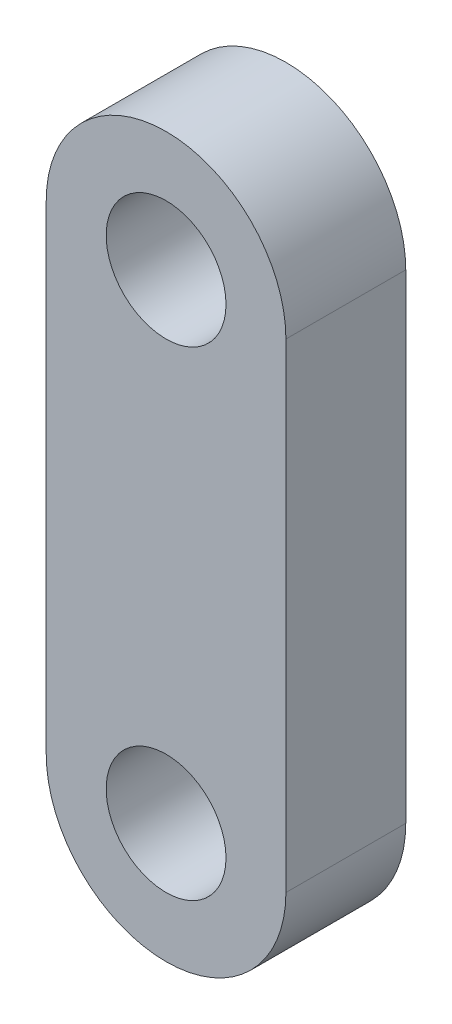
ISO-10303-21;
HEADER;
FILE_DESCRIPTION(('STEP AP214'),'2;1');
FILE_NAME('part.step','',(''),(''),'','','');
FILE_SCHEMA(('AUTOMOTIVE_DESIGN { 1 0 10303 214 1 1 1 1 }'));
ENDSEC;
DATA;
#1=APPLICATION_CONTEXT('core data for automotive mechanical design processes');
#2=APPLICATION_PROTOCOL_DEFINITION('international standard','automotive_design',2000,#1);
#3=PRODUCT_CONTEXT('',#1,'mechanical');
#4=PRODUCT('Part','Part','',(#3));
#5=PRODUCT_RELATED_PRODUCT_CATEGORY('part','',(#4));
#6=PRODUCT_DEFINITION_FORMATION('','',#4);
#7=PRODUCT_DEFINITION_CONTEXT('part definition',#1,'design');
#8=PRODUCT_DEFINITION('design','',#6,#7);
#9=PRODUCT_DEFINITION_SHAPE('','',#8);
#10=(LENGTH_UNIT() NAMED_UNIT(*) SI_UNIT(.MILLI.,.METRE.));
#11=(NAMED_UNIT(*) PLANE_ANGLE_UNIT() SI_UNIT($,.RADIAN.));
#12=(NAMED_UNIT(*) SI_UNIT($,.STERADIAN.) SOLID_ANGLE_UNIT());
#13=UNCERTAINTY_MEASURE_WITH_UNIT(LENGTH_MEASURE(1.E-05),#10,'distance_accuracy_value','');
#14=(GEOMETRIC_REPRESENTATION_CONTEXT(3) GLOBAL_UNCERTAINTY_ASSIGNED_CONTEXT((#13)) GLOBAL_UNIT_ASSIGNED_CONTEXT((#10,
#11,#12)) REPRESENTATION_CONTEXT('',''));
#15=CARTESIAN_POINT('',(0.,0.,0.));
#16=DIRECTION('',(0.,0.,1.));
#17=DIRECTION('',(1.,0.,0.));
#18=AXIS2_PLACEMENT_3D('',#15,#16,#17);
#19=CARTESIAN_POINT('',(0.,25.4,6.35));
#20=DIRECTION('',(0.,0.,1.));
#21=DIRECTION('',(1.,0.,0.));
#22=AXIS2_PLACEMENT_3D('',#19,#20,#21);
#23=PLANE('',#22);
#24=CARTESIAN_POINT('',(0.,0.,6.35));
#25=DIRECTION('',(0.,0.,1.));
#26=DIRECTION('',(1.,0.,0.));
#27=AXIS2_PLACEMENT_3D('',#24,#25,#26);
#28=CIRCLE('',#27,3.175);
#29=CARTESIAN_POINT('',(3.175,0.,6.35));
#30=VERTEX_POINT('',#29);
#31=EDGE_CURVE('E103',#30,#30,#28,.T.);
#32=ORIENTED_EDGE('',*,*,#31,.F.);
#33=EDGE_LOOP('',(#32));
#34=FACE_BOUND('',#33,.T.);
#35=CARTESIAN_POINT('',(0.,25.4,6.35));
#36=DIRECTION('',(0.,0.,1.));
#37=DIRECTION('',(1.,0.,0.));
#38=AXIS2_PLACEMENT_3D('',#35,#36,#37);
#39=CIRCLE('',#38,6.35);
#40=CARTESIAN_POINT('',(6.35,25.4,6.35));
#41=VERTEX_POINT('',#40);
#42=CARTESIAN_POINT('',(-6.35,25.4,6.35));
#43=VERTEX_POINT('',#42);
#44=EDGE_CURVE('E88',#41,#43,#39,.T.);
#45=ORIENTED_EDGE('',*,*,#44,.T.);
#46=DIRECTION('',(0.,-1.,0.));
#47=VECTOR('',#46,1.);
#48=CARTESIAN_POINT('',(-6.35,25.4,6.35));
#49=LINE('',#48,#47);
#50=CARTESIAN_POINT('',(-6.35,0.,6.35));
#51=VERTEX_POINT('',#50);
#52=EDGE_CURVE('E83',#43,#51,#49,.T.);
#53=ORIENTED_EDGE('',*,*,#52,.T.);
#54=CARTESIAN_POINT('',(0.,0.,6.35));
#55=DIRECTION('',(0.,0.,1.));
#56=DIRECTION('',(1.,0.,0.));
#57=AXIS2_PLACEMENT_3D('',#54,#55,#56);
#58=CIRCLE('',#57,6.35);
#59=CARTESIAN_POINT('',(6.35,0.,6.35));
#60=VERTEX_POINT('',#59);
#61=EDGE_CURVE('E86',#51,#60,#58,.T.);
#62=ORIENTED_EDGE('',*,*,#61,.T.);
#63=DIRECTION('',(0.,1.,0.));
#64=VECTOR('',#63,1.);
#65=CARTESIAN_POINT('',(6.35,25.4,6.35));
#66=LINE('',#65,#64);
#67=EDGE_CURVE('E53',#60,#41,#66,.T.);
#68=ORIENTED_EDGE('',*,*,#67,.T.);
#69=EDGE_LOOP('',(#45,#53,#62,#68));
#70=FACE_BOUND('',#69,.T.);
#71=CARTESIAN_POINT('',(0.,25.4,6.35));
#72=DIRECTION('',(0.,0.,1.));
#73=DIRECTION('',(1.,0.,0.));
#74=AXIS2_PLACEMENT_3D('',#71,#72,#73);
#75=CIRCLE('',#74,3.175);
#76=CARTESIAN_POINT('',(3.175,25.4,6.35));
#77=VERTEX_POINT('',#76);
#78=EDGE_CURVE('E118',#77,#77,#75,.T.);
#79=ORIENTED_EDGE('',*,*,#78,.F.);
#80=EDGE_LOOP('',(#79));
#81=FACE_BOUND('',#80,.T.);
#82=ADVANCED_FACE('F36',(#34,#70,#81),#23,.T.);
#83=CARTESIAN_POINT('',(0.,25.4,0.));
#84=DIRECTION('',(0.,0.,1.));
#85=DIRECTION('',(1.,0.,0.));
#86=AXIS2_PLACEMENT_3D('',#83,#84,#85);
#87=PLANE('',#86);
#88=CARTESIAN_POINT('',(0.,25.4,0.));
#89=DIRECTION('',(0.,0.,1.));
#90=DIRECTION('',(1.,0.,0.));
#91=AXIS2_PLACEMENT_3D('',#88,#89,#90);
#92=CIRCLE('',#91,6.35);
#93=CARTESIAN_POINT('',(6.35,25.4,0.));
#94=VERTEX_POINT('',#93);
#95=CARTESIAN_POINT('',(-6.35,25.4,0.));
#96=VERTEX_POINT('',#95);
#97=EDGE_CURVE('E100',#94,#96,#92,.T.);
#98=ORIENTED_EDGE('',*,*,#97,.F.);
#99=DIRECTION('',(0.,1.,0.));
#100=VECTOR('',#99,1.);
#101=CARTESIAN_POINT('',(6.35,25.4,0.));
#102=LINE('',#101,#100);
#103=CARTESIAN_POINT('',(6.35,0.,0.));
#104=VERTEX_POINT('',#103);
#105=EDGE_CURVE('E76',#104,#94,#102,.T.);
#106=ORIENTED_EDGE('',*,*,#105,.F.);
#107=CARTESIAN_POINT('',(0.,0.,0.));
#108=DIRECTION('',(0.,0.,1.));
#109=DIRECTION('',(1.,0.,0.));
#110=AXIS2_PLACEMENT_3D('',#107,#108,#109);
#111=CIRCLE('',#110,6.35);
#112=CARTESIAN_POINT('',(-6.35,0.,0.));
#113=VERTEX_POINT('',#112);
#114=EDGE_CURVE('E70',#113,#104,#111,.T.);
#115=ORIENTED_EDGE('',*,*,#114,.F.);
#116=DIRECTION('',(0.,-1.,0.));
#117=VECTOR('',#116,1.);
#118=CARTESIAN_POINT('',(-6.35,25.4,0.));
#119=LINE('',#118,#117);
#120=EDGE_CURVE('E92',#96,#113,#119,.T.);
#121=ORIENTED_EDGE('',*,*,#120,.F.);
#122=EDGE_LOOP('',(#98,#106,#115,#121));
#123=FACE_BOUND('',#122,.T.);
#124=CARTESIAN_POINT('',(0.,0.,0.));
#125=DIRECTION('',(0.,0.,1.));
#126=DIRECTION('',(1.,0.,0.));
#127=AXIS2_PLACEMENT_3D('',#124,#125,#126);
#128=CIRCLE('',#127,3.175);
#129=CARTESIAN_POINT('',(3.175,0.,0.));
#130=VERTEX_POINT('',#129);
#131=EDGE_CURVE('E115',#130,#130,#128,.T.);
#132=ORIENTED_EDGE('',*,*,#131,.T.);
#133=EDGE_LOOP('',(#132));
#134=FACE_BOUND('',#133,.T.);
#135=CARTESIAN_POINT('',(0.,25.4,0.));
#136=DIRECTION('',(0.,0.,1.));
#137=DIRECTION('',(1.,0.,0.));
#138=AXIS2_PLACEMENT_3D('',#135,#136,#137);
#139=CIRCLE('',#138,3.175);
#140=CARTESIAN_POINT('',(3.175,25.4,0.));
#141=VERTEX_POINT('',#140);
#142=EDGE_CURVE('E121',#141,#141,#139,.T.);
#143=ORIENTED_EDGE('',*,*,#142,.T.);
#144=EDGE_LOOP('',(#143));
#145=FACE_BOUND('',#144,.T.);
#146=ADVANCED_FACE('F111',(#123,#134,#145),#87,.F.);
#147=CARTESIAN_POINT('',(0.,25.4,6.35));
#148=DIRECTION('',(0.,0.,-1.));
#149=DIRECTION('',(-1.,0.,0.));
#150=AXIS2_PLACEMENT_3D('',#147,#148,#149);
#151=CYLINDRICAL_SURFACE('',#150,6.35);
#152=ORIENTED_EDGE('',*,*,#97,.T.);
#153=DIRECTION('',(0.,0.,-1.));
#154=VECTOR('',#153,1.);
#155=CARTESIAN_POINT('',(-6.35,25.4,6.35));
#156=LINE('',#155,#154);
#157=EDGE_CURVE('E11',#43,#96,#156,.T.);
#158=ORIENTED_EDGE('',*,*,#157,.F.);
#159=ORIENTED_EDGE('',*,*,#44,.F.);
#160=DIRECTION('',(0.,0.,-1.));
#161=VECTOR('',#160,1.);
#162=CARTESIAN_POINT('',(6.35,25.4,6.35));
#163=LINE('',#162,#161);
#164=EDGE_CURVE('E96',#41,#94,#163,.T.);
#165=ORIENTED_EDGE('',*,*,#164,.T.);
#166=EDGE_LOOP('',(#152,#158,#159,#165));
#167=FACE_BOUND('',#166,.T.);
#168=ADVANCED_FACE('F38',(#167),#151,.T.);
#169=CARTESIAN_POINT('',(-6.35,25.4,6.35));
#170=DIRECTION('',(1.,0.,0.));
#171=DIRECTION('',(0.,0.,-1.));
#172=AXIS2_PLACEMENT_3D('',#169,#170,#171);
#173=PLANE('',#172);
#174=ORIENTED_EDGE('',*,*,#120,.T.);
#175=DIRECTION('',(0.,0.,-1.));
#176=VECTOR('',#175,1.);
#177=CARTESIAN_POINT('',(-6.35,0.,6.35));
#178=LINE('',#177,#176);
#179=EDGE_CURVE('E45',#51,#113,#178,.T.);
#180=ORIENTED_EDGE('',*,*,#179,.F.);
#181=ORIENTED_EDGE('',*,*,#52,.F.);
#182=ORIENTED_EDGE('',*,*,#157,.T.);
#183=EDGE_LOOP('',(#174,#180,#181,#182));
#184=FACE_BOUND('',#183,.T.);
#185=ADVANCED_FACE('F91',(#184),#173,.F.);
#186=CARTESIAN_POINT('',(0.,0.,6.35));
#187=DIRECTION('',(0.,0.,-1.));
#188=DIRECTION('',(-1.,0.,0.));
#189=AXIS2_PLACEMENT_3D('',#186,#187,#188);
#190=CYLINDRICAL_SURFACE('',#189,6.35);
#191=ORIENTED_EDGE('',*,*,#114,.T.);
#192=DIRECTION('',(0.,0.,-1.));
#193=VECTOR('',#192,1.);
#194=CARTESIAN_POINT('',(6.35,0.,6.35));
#195=LINE('',#194,#193);
#196=EDGE_CURVE('E93',#60,#104,#195,.T.);
#197=ORIENTED_EDGE('',*,*,#196,.F.);
#198=ORIENTED_EDGE('',*,*,#61,.F.);
#199=ORIENTED_EDGE('',*,*,#179,.T.);
#200=EDGE_LOOP('',(#191,#197,#198,#199));
#201=FACE_BOUND('',#200,.T.);
#202=ADVANCED_FACE('F94',(#201),#190,.T.);
#203=CARTESIAN_POINT('',(6.35,25.4,6.35));
#204=DIRECTION('',(-1.,0.,0.));
#205=DIRECTION('',(0.,0.,1.));
#206=AXIS2_PLACEMENT_3D('',#203,#204,#205);
#207=PLANE('',#206);
#208=ORIENTED_EDGE('',*,*,#105,.T.);
#209=ORIENTED_EDGE('',*,*,#164,.F.);
#210=ORIENTED_EDGE('',*,*,#67,.F.);
#211=ORIENTED_EDGE('',*,*,#196,.T.);
#212=EDGE_LOOP('',(#208,#209,#210,#211));
#213=FACE_BOUND('',#212,.T.);
#214=ADVANCED_FACE('F108',(#213),#207,.F.);
#215=CARTESIAN_POINT('',(0.,0.,6.35));
#216=DIRECTION('',(0.,0.,-1.));
#217=DIRECTION('',(-1.,0.,0.));
#218=AXIS2_PLACEMENT_3D('',#215,#216,#217);
#219=CYLINDRICAL_SURFACE('',#218,3.175);
#220=ORIENTED_EDGE('',*,*,#31,.T.);
#221=EDGE_LOOP('',(#220));
#222=FACE_BOUND('',#221,.T.);
#223=ORIENTED_EDGE('',*,*,#131,.F.);
#224=EDGE_LOOP('',(#223));
#225=FACE_BOUND('',#224,.T.);
#226=ADVANCED_FACE('F138',(#222,#225),#219,.F.);
#227=CARTESIAN_POINT('',(0.,25.4,6.35));
#228=DIRECTION('',(0.,0.,-1.));
#229=DIRECTION('',(-1.,0.,0.));
#230=AXIS2_PLACEMENT_3D('',#227,#228,#229);
#231=CYLINDRICAL_SURFACE('',#230,3.175);
#232=ORIENTED_EDGE('',*,*,#78,.T.);
#233=EDGE_LOOP('',(#232));
#234=FACE_BOUND('',#233,.T.);
#235=ORIENTED_EDGE('',*,*,#142,.F.);
#236=EDGE_LOOP('',(#235));
#237=FACE_BOUND('',#236,.T.);
#238=ADVANCED_FACE('F127',(#234,#237),#231,.F.);
#239=CLOSED_SHELL('',(#82,#146,#168,#185,#202,#214,#226,#238));
#240=MANIFOLD_SOLID_BREP('B2',#239);
#241=ADVANCED_BREP_SHAPE_REPRESENTATION('',(#18,#240),#14);
#242=SHAPE_DEFINITION_REPRESENTATION(#9,#241);
ENDSEC;
END-ISO-10303-21;
